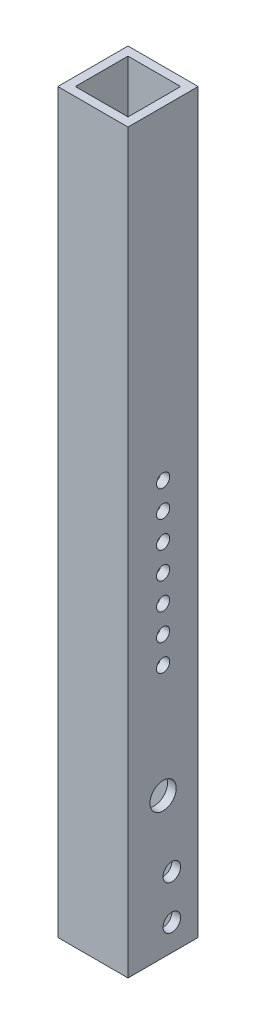
ISO-10303-21;
HEADER;
FILE_DESCRIPTION(('STEP AP214'),'2;1');
FILE_NAME('part.step','',(''),(''),'','','');
FILE_SCHEMA(('AUTOMOTIVE_DESIGN { 1 0 10303 214 1 1 1 1 }'));
ENDSEC;
DATA;
#1=APPLICATION_CONTEXT('core data for automotive mechanical design processes');
#2=APPLICATION_PROTOCOL_DEFINITION('international standard','automotive_design',2000,#1);
#3=PRODUCT_CONTEXT('',#1,'mechanical');
#4=PRODUCT('Part','Part','',(#3));
#5=PRODUCT_RELATED_PRODUCT_CATEGORY('part','',(#4));
#6=PRODUCT_DEFINITION_FORMATION('','',#4);
#7=PRODUCT_DEFINITION_CONTEXT('part definition',#1,'design');
#8=PRODUCT_DEFINITION('design','',#6,#7);
#9=PRODUCT_DEFINITION_SHAPE('','',#8);
#10=(LENGTH_UNIT() NAMED_UNIT(*) SI_UNIT(.MILLI.,.METRE.));
#11=(NAMED_UNIT(*) PLANE_ANGLE_UNIT() SI_UNIT($,.RADIAN.));
#12=(NAMED_UNIT(*) SI_UNIT($,.STERADIAN.) SOLID_ANGLE_UNIT());
#13=UNCERTAINTY_MEASURE_WITH_UNIT(LENGTH_MEASURE(1.E-05),#10,'distance_accuracy_value','');
#14=(GEOMETRIC_REPRESENTATION_CONTEXT(3) GLOBAL_UNCERTAINTY_ASSIGNED_CONTEXT((#13)) GLOBAL_UNIT_ASSIGNED_CONTEXT((#10,
#11,#12)) REPRESENTATION_CONTEXT('',''));
#15=CARTESIAN_POINT('',(0.,0.,0.));
#16=DIRECTION('',(0.,0.,1.));
#17=DIRECTION('',(1.,0.,0.));
#18=AXIS2_PLACEMENT_3D('',#15,#16,#17);
#19=CARTESIAN_POINT('',(12.7,-38.1,12.7));
#20=DIRECTION('',(1.,0.,0.));
#21=DIRECTION('',(0.,0.,-1.));
#22=AXIS2_PLACEMENT_3D('',#19,#20,#21);
#23=PLANE('',#22);
#24=CARTESIAN_POINT('',(12.7,-28.575,-3.175));
#25=DIRECTION('',(1.,0.,0.));
#26=DIRECTION('',(0.,0.,-1.));
#27=AXIS2_PLACEMENT_3D('',#24,#25,#26);
#28=CIRCLE('',#27,3.175);
#29=CARTESIAN_POINT('',(12.7,-28.575,-6.35));
#30=VERTEX_POINT('',#29);
#31=EDGE_CURVE('E354',#30,#30,#28,.T.);
#32=ORIENTED_EDGE('',*,*,#31,.F.);
#33=EDGE_LOOP('',(#32));
#34=FACE_BOUND('',#33,.T.);
#35=CARTESIAN_POINT('',(12.7,92.202,0.));
#36=DIRECTION('',(1.,0.,0.));
#37=DIRECTION('',(0.,0.,-1.));
#38=AXIS2_PLACEMENT_3D('',#35,#36,#37);
#39=CIRCLE('',#38,2.38125);
#40=CARTESIAN_POINT('',(12.7,92.202,-2.38124999999993));
#41=VERTEX_POINT('',#40);
#42=EDGE_CURVE('E358',#41,#41,#39,.T.);
#43=ORIENTED_EDGE('',*,*,#42,.F.);
#44=EDGE_LOOP('',(#43));
#45=FACE_BOUND('',#44,.T.);
#46=CARTESIAN_POINT('',(12.7,-12.7,-3.175));
#47=DIRECTION('',(1.,0.,0.));
#48=DIRECTION('',(0.,0.,-1.));
#49=AXIS2_PLACEMENT_3D('',#46,#47,#48);
#50=CIRCLE('',#49,3.175);
#51=CARTESIAN_POINT('',(12.7,-12.7,-6.35));
#52=VERTEX_POINT('',#51);
#53=EDGE_CURVE('E362',#52,#52,#50,.T.);
#54=ORIENTED_EDGE('',*,*,#53,.F.);
#55=EDGE_LOOP('',(#54));
#56=FACE_BOUND('',#55,.T.);
#57=CARTESIAN_POINT('',(12.7,63.246,0.));
#58=DIRECTION('',(1.,0.,0.));
#59=DIRECTION('',(0.,0.,-1.));
#60=AXIS2_PLACEMENT_3D('',#57,#58,#59);
#61=CIRCLE('',#60,2.38125);
#62=CARTESIAN_POINT('',(12.7,63.246,-2.38125));
#63=VERTEX_POINT('',#62);
#64=EDGE_CURVE('E366',#63,#63,#61,.T.);
#65=ORIENTED_EDGE('',*,*,#64,.F.);
#66=EDGE_LOOP('',(#65));
#67=FACE_BOUND('',#66,.T.);
#68=CARTESIAN_POINT('',(12.7,72.898,0.));
#69=DIRECTION('',(1.,0.,0.));
#70=DIRECTION('',(0.,0.,-1.));
#71=AXIS2_PLACEMENT_3D('',#68,#69,#70);
#72=CIRCLE('',#71,2.38125);
#73=CARTESIAN_POINT('',(12.7,72.898,-2.38125));
#74=VERTEX_POINT('',#73);
#75=EDGE_CURVE('E370',#74,#74,#72,.T.);
#76=ORIENTED_EDGE('',*,*,#75,.F.);
#77=EDGE_LOOP('',(#76));
#78=FACE_BOUND('',#77,.T.);
#79=CARTESIAN_POINT('',(12.7,82.55,0.));
#80=DIRECTION('',(1.,0.,0.));
#81=DIRECTION('',(0.,0.,-1.));
#82=AXIS2_PLACEMENT_3D('',#79,#80,#81);
#83=CIRCLE('',#82,2.38125);
#84=CARTESIAN_POINT('',(12.7,82.55,-2.38125));
#85=VERTEX_POINT('',#84);
#86=EDGE_CURVE('E374',#85,#85,#83,.T.);
#87=ORIENTED_EDGE('',*,*,#86,.F.);
#88=EDGE_LOOP('',(#87));
#89=FACE_BOUND('',#88,.T.);
#90=CARTESIAN_POINT('',(12.7,101.854,0.));
#91=DIRECTION('',(1.,0.,0.));
#92=DIRECTION('',(0.,0.,-1.));
#93=AXIS2_PLACEMENT_3D('',#90,#91,#92);
#94=CIRCLE('',#93,2.38125);
#95=CARTESIAN_POINT('',(12.7,101.854,-2.3812499999999));
#96=VERTEX_POINT('',#95);
#97=EDGE_CURVE('E378',#96,#96,#94,.T.);
#98=ORIENTED_EDGE('',*,*,#97,.F.);
#99=EDGE_LOOP('',(#98));
#100=FACE_BOUND('',#99,.T.);
#101=CARTESIAN_POINT('',(12.7,111.506,0.));
#102=DIRECTION('',(1.,0.,0.));
#103=DIRECTION('',(0.,0.,-1.));
#104=AXIS2_PLACEMENT_3D('',#101,#102,#103);
#105=CIRCLE('',#104,2.38125);
#106=CARTESIAN_POINT('',(12.7,111.506,-2.3812499999999));
#107=VERTEX_POINT('',#106);
#108=EDGE_CURVE('E382',#107,#107,#105,.T.);
#109=ORIENTED_EDGE('',*,*,#108,.F.);
#110=EDGE_LOOP('',(#109));
#111=FACE_BOUND('',#110,.T.);
#112=CARTESIAN_POINT('',(12.7,12.7,0.));
#113=DIRECTION('',(1.,0.,0.));
#114=DIRECTION('',(0.,0.,-1.));
#115=AXIS2_PLACEMENT_3D('',#112,#113,#114);
#116=CIRCLE('',#115,4.7625);
#117=CARTESIAN_POINT('',(12.7,12.7,-4.7625));
#118=VERTEX_POINT('',#117);
#119=EDGE_CURVE('E386',#118,#118,#116,.T.);
#120=ORIENTED_EDGE('',*,*,#119,.F.);
#121=EDGE_LOOP('',(#120));
#122=FACE_BOUND('',#121,.T.);
#123=CARTESIAN_POINT('',(12.7,53.594,0.));
#124=DIRECTION('',(1.,0.,0.));
#125=DIRECTION('',(0.,0.,-1.));
#126=AXIS2_PLACEMENT_3D('',#123,#124,#125);
#127=CIRCLE('',#126,2.38125);
#128=CARTESIAN_POINT('',(12.7,53.594,-2.38125));
#129=VERTEX_POINT('',#128);
#130=EDGE_CURVE('E390',#129,#129,#127,.T.);
#131=ORIENTED_EDGE('',*,*,#130,.F.);
#132=EDGE_LOOP('',(#131));
#133=FACE_BOUND('',#132,.T.);
#134=DIRECTION('',(0.,1.,0.));
#135=VECTOR('',#134,1.);
#136=CARTESIAN_POINT('',(12.7,-38.1,-12.7));
#137=LINE('',#136,#135);
#138=CARTESIAN_POINT('',(12.7,-38.1,-12.7));
#139=VERTEX_POINT('',#138);
#140=CARTESIAN_POINT('',(12.7,228.6,-12.7));
#141=VERTEX_POINT('',#140);
#142=EDGE_CURVE('E243',#139,#141,#137,.T.);
#143=ORIENTED_EDGE('',*,*,#142,.T.);
#144=DIRECTION('',(0.,0.,-1.));
#145=VECTOR('',#144,1.);
#146=CARTESIAN_POINT('',(12.7,228.6,12.7));
#147=LINE('',#146,#145);
#148=CARTESIAN_POINT('',(12.7,228.6,12.7));
#149=VERTEX_POINT('',#148);
#150=EDGE_CURVE('E184',#149,#141,#147,.T.);
#151=ORIENTED_EDGE('',*,*,#150,.F.);
#152=DIRECTION('',(0.,1.,0.));
#153=VECTOR('',#152,1.);
#154=CARTESIAN_POINT('',(12.7,-38.1,12.7));
#155=LINE('',#154,#153);
#156=CARTESIAN_POINT('',(12.7,-38.1,12.7));
#157=VERTEX_POINT('',#156);
#158=EDGE_CURVE('E11',#157,#149,#155,.T.);
#159=ORIENTED_EDGE('',*,*,#158,.F.);
#160=DIRECTION('',(0.,0.,-1.));
#161=VECTOR('',#160,1.);
#162=CARTESIAN_POINT('',(12.7,-38.1,12.7));
#163=LINE('',#162,#161);
#164=EDGE_CURVE('E220',#157,#139,#163,.T.);
#165=ORIENTED_EDGE('',*,*,#164,.T.);
#166=EDGE_LOOP('',(#143,#151,#159,#165));
#167=FACE_BOUND('',#166,.T.);
#168=ADVANCED_FACE('F43',(#34,#45,#56,#67,#78,#89,#100,#111,#122,#133,#167),#23,.T.);
#169=CARTESIAN_POINT('',(-12.7,-38.1,12.7));
#170=DIRECTION('',(0.,0.,1.));
#171=DIRECTION('',(1.,0.,0.));
#172=AXIS2_PLACEMENT_3D('',#169,#170,#171);
#173=PLANE('',#172);
#174=ORIENTED_EDGE('',*,*,#158,.T.);
#175=DIRECTION('',(1.,0.,0.));
#176=VECTOR('',#175,1.);
#177=CARTESIAN_POINT('',(-12.7,228.6,12.7));
#178=LINE('',#177,#176);
#179=CARTESIAN_POINT('',(-12.7,228.6,12.7));
#180=VERTEX_POINT('',#179);
#181=EDGE_CURVE('E196',#180,#149,#178,.T.);
#182=ORIENTED_EDGE('',*,*,#181,.F.);
#183=DIRECTION('',(0.,1.,0.));
#184=VECTOR('',#183,1.);
#185=CARTESIAN_POINT('',(-12.7,-38.1,12.7));
#186=LINE('',#185,#184);
#187=CARTESIAN_POINT('',(-12.7,-38.1,12.7));
#188=VERTEX_POINT('',#187);
#189=EDGE_CURVE('E52',#188,#180,#186,.T.);
#190=ORIENTED_EDGE('',*,*,#189,.F.);
#191=DIRECTION('',(1.,0.,0.));
#192=VECTOR('',#191,1.);
#193=CARTESIAN_POINT('',(-12.7,-38.1,12.7));
#194=LINE('',#193,#192);
#195=EDGE_CURVE('E240',#188,#157,#194,.T.);
#196=ORIENTED_EDGE('',*,*,#195,.T.);
#197=EDGE_LOOP('',(#174,#182,#190,#196));
#198=FACE_BOUND('',#197,.T.);
#199=ADVANCED_FACE('F343',(#198),#173,.T.);
#200=CARTESIAN_POINT('',(-12.7,-38.1,12.7));
#201=DIRECTION('',(-1.,0.,0.));
#202=DIRECTION('',(0.,0.,1.));
#203=AXIS2_PLACEMENT_3D('',#200,#201,#202);
#204=PLANE('',#203);
#205=CARTESIAN_POINT('',(-12.7,-28.575,-3.175));
#206=DIRECTION('',(1.,0.,0.));
#207=DIRECTION('',(0.,0.,-1.));
#208=AXIS2_PLACEMENT_3D('',#205,#206,#207);
#209=CIRCLE('',#208,3.175);
#210=CARTESIAN_POINT('',(-12.7,-28.575,-6.35));
#211=VERTEX_POINT('',#210);
#212=EDGE_CURVE('E257',#211,#211,#209,.T.);
#213=ORIENTED_EDGE('',*,*,#212,.T.);
#214=EDGE_LOOP('',(#213));
#215=FACE_BOUND('',#214,.T.);
#216=CARTESIAN_POINT('',(-12.7,92.202,0.));
#217=DIRECTION('',(1.,0.,0.));
#218=DIRECTION('',(0.,0.,-1.));
#219=AXIS2_PLACEMENT_3D('',#216,#217,#218);
#220=CIRCLE('',#219,2.38125);
#221=CARTESIAN_POINT('',(-12.7,92.202,-2.38124999999993));
#222=VERTEX_POINT('',#221);
#223=EDGE_CURVE('E908',#222,#222,#220,.T.);
#224=ORIENTED_EDGE('',*,*,#223,.T.);
#225=EDGE_LOOP('',(#224));
#226=FACE_BOUND('',#225,.T.);
#227=CARTESIAN_POINT('',(-12.7,-12.7,-3.175));
#228=DIRECTION('',(1.,0.,0.));
#229=DIRECTION('',(0.,0.,-1.));
#230=AXIS2_PLACEMENT_3D('',#227,#228,#229);
#231=CIRCLE('',#230,3.175);
#232=CARTESIAN_POINT('',(-12.7,-12.7,-6.35));
#233=VERTEX_POINT('',#232);
#234=EDGE_CURVE('E878',#233,#233,#231,.T.);
#235=ORIENTED_EDGE('',*,*,#234,.T.);
#236=EDGE_LOOP('',(#235));
#237=FACE_BOUND('',#236,.T.);
#238=CARTESIAN_POINT('',(-12.7,63.246,0.));
#239=DIRECTION('',(1.,0.,0.));
#240=DIRECTION('',(0.,0.,-1.));
#241=AXIS2_PLACEMENT_3D('',#238,#239,#240);
#242=CIRCLE('',#241,2.38125);
#243=CARTESIAN_POINT('',(-12.7,63.246,-2.38125));
#244=VERTEX_POINT('',#243);
#245=EDGE_CURVE('E872',#244,#244,#242,.T.);
#246=ORIENTED_EDGE('',*,*,#245,.T.);
#247=EDGE_LOOP('',(#246));
#248=FACE_BOUND('',#247,.T.);
#249=CARTESIAN_POINT('',(-12.7,72.898,0.));
#250=DIRECTION('',(1.,0.,0.));
#251=DIRECTION('',(0.,0.,-1.));
#252=AXIS2_PLACEMENT_3D('',#249,#250,#251);
#253=CIRCLE('',#252,2.38125);
#254=CARTESIAN_POINT('',(-12.7,72.898,-2.38125));
#255=VERTEX_POINT('',#254);
#256=EDGE_CURVE('E866',#255,#255,#253,.T.);
#257=ORIENTED_EDGE('',*,*,#256,.T.);
#258=EDGE_LOOP('',(#257));
#259=FACE_BOUND('',#258,.T.);
#260=CARTESIAN_POINT('',(-12.7,82.55,0.));
#261=DIRECTION('',(1.,0.,0.));
#262=DIRECTION('',(0.,0.,-1.));
#263=AXIS2_PLACEMENT_3D('',#260,#261,#262);
#264=CIRCLE('',#263,2.38125);
#265=CARTESIAN_POINT('',(-12.7,82.55,-2.38125));
#266=VERTEX_POINT('',#265);
#267=EDGE_CURVE('E851',#266,#266,#264,.T.);
#268=ORIENTED_EDGE('',*,*,#267,.T.);
#269=EDGE_LOOP('',(#268));
#270=FACE_BOUND('',#269,.T.);
#271=CARTESIAN_POINT('',(-12.7,101.854,0.));
#272=DIRECTION('',(1.,0.,0.));
#273=DIRECTION('',(0.,0.,-1.));
#274=AXIS2_PLACEMENT_3D('',#271,#272,#273);
#275=CIRCLE('',#274,2.38125);
#276=CARTESIAN_POINT('',(-12.7,101.854,-2.3812499999999));
#277=VERTEX_POINT('',#276);
#278=EDGE_CURVE('E902',#277,#277,#275,.T.);
#279=ORIENTED_EDGE('',*,*,#278,.T.);
#280=EDGE_LOOP('',(#279));
#281=FACE_BOUND('',#280,.T.);
#282=CARTESIAN_POINT('',(-12.7,111.506,0.));
#283=DIRECTION('',(1.,0.,0.));
#284=DIRECTION('',(0.,0.,-1.));
#285=AXIS2_PLACEMENT_3D('',#282,#283,#284);
#286=CIRCLE('',#285,2.38125);
#287=CARTESIAN_POINT('',(-12.7,111.506,-2.3812499999999));
#288=VERTEX_POINT('',#287);
#289=EDGE_CURVE('E896',#288,#288,#286,.T.);
#290=ORIENTED_EDGE('',*,*,#289,.T.);
#291=EDGE_LOOP('',(#290));
#292=FACE_BOUND('',#291,.T.);
#293=CARTESIAN_POINT('',(-12.7,12.7,0.));
#294=DIRECTION('',(1.,0.,0.));
#295=DIRECTION('',(0.,0.,-1.));
#296=AXIS2_PLACEMENT_3D('',#293,#294,#295);
#297=CIRCLE('',#296,4.7625);
#298=CARTESIAN_POINT('',(-12.7,12.7,-4.7625));
#299=VERTEX_POINT('',#298);
#300=EDGE_CURVE('E890',#299,#299,#297,.T.);
#301=ORIENTED_EDGE('',*,*,#300,.T.);
#302=EDGE_LOOP('',(#301));
#303=FACE_BOUND('',#302,.T.);
#304=CARTESIAN_POINT('',(-12.7,53.594,0.));
#305=DIRECTION('',(1.,0.,0.));
#306=DIRECTION('',(0.,0.,-1.));
#307=AXIS2_PLACEMENT_3D('',#304,#305,#306);
#308=CIRCLE('',#307,2.38125);
#309=CARTESIAN_POINT('',(-12.7,53.594,-2.38125));
#310=VERTEX_POINT('',#309);
#311=EDGE_CURVE('E884',#310,#310,#308,.T.);
#312=ORIENTED_EDGE('',*,*,#311,.T.);
#313=EDGE_LOOP('',(#312));
#314=FACE_BOUND('',#313,.T.);
#315=ORIENTED_EDGE('',*,*,#189,.T.);
#316=DIRECTION('',(0.,0.,1.));
#317=VECTOR('',#316,1.);
#318=CARTESIAN_POINT('',(-12.7,228.6,12.7));
#319=LINE('',#318,#317);
#320=CARTESIAN_POINT('',(-12.7,228.6,-12.7));
#321=VERTEX_POINT('',#320);
#322=EDGE_CURVE('E192',#321,#180,#319,.T.);
#323=ORIENTED_EDGE('',*,*,#322,.F.);
#324=DIRECTION('',(0.,1.,0.));
#325=VECTOR('',#324,1.);
#326=CARTESIAN_POINT('',(-12.7,-38.1,-12.7));
#327=LINE('',#326,#325);
#328=CARTESIAN_POINT('',(-12.7,-38.1,-12.7));
#329=VERTEX_POINT('',#328);
#330=EDGE_CURVE('E247',#329,#321,#327,.T.);
#331=ORIENTED_EDGE('',*,*,#330,.F.);
#332=DIRECTION('',(0.,0.,1.));
#333=VECTOR('',#332,1.);
#334=CARTESIAN_POINT('',(-12.7,-38.1,12.7));
#335=LINE('',#334,#333);
#336=EDGE_CURVE('E236',#329,#188,#335,.T.);
#337=ORIENTED_EDGE('',*,*,#336,.T.);
#338=EDGE_LOOP('',(#315,#323,#331,#337));
#339=FACE_BOUND('',#338,.T.);
#340=ADVANCED_FACE('F348',(#215,#226,#237,#248,#259,#270,#281,#292,#303,#314,#339),#204,.T.);
#341=CARTESIAN_POINT('',(-12.7,-38.1,-12.7));
#342=DIRECTION('',(0.,0.,-1.));
#343=DIRECTION('',(-1.,0.,0.));
#344=AXIS2_PLACEMENT_3D('',#341,#342,#343);
#345=PLANE('',#344);
#346=DIRECTION('',(1.,0.,0.));
#347=VECTOR('',#346,1.);
#348=CARTESIAN_POINT('',(5.07999999999999,120.65,-12.7));
#349=LINE('',#348,#347);
#350=CARTESIAN_POINT('',(-5.08000000000001,120.65,-12.7));
#351=VERTEX_POINT('',#350);
#352=CARTESIAN_POINT('',(5.07999999999999,120.65,-12.7));
#353=VERTEX_POINT('',#352);
#354=EDGE_CURVE('E321',#351,#353,#349,.T.);
#355=ORIENTED_EDGE('',*,*,#354,.F.);
#356=DIRECTION('',(0.,1.,0.));
#357=VECTOR('',#356,1.);
#358=CARTESIAN_POINT('',(-5.08,44.45,-12.7));
#359=LINE('',#358,#357);
#360=CARTESIAN_POINT('',(-5.08,44.45,-12.7));
#361=VERTEX_POINT('',#360);
#362=EDGE_CURVE('E157',#361,#351,#359,.T.);
#363=ORIENTED_EDGE('',*,*,#362,.F.);
#364=DIRECTION('',(-1.,0.,0.));
#365=VECTOR('',#364,1.);
#366=CARTESIAN_POINT('',(5.08,44.45,-12.7));
#367=LINE('',#366,#365);
#368=CARTESIAN_POINT('',(5.08,44.45,-12.7));
#369=VERTEX_POINT('',#368);
#370=EDGE_CURVE('E60',#369,#361,#367,.T.);
#371=ORIENTED_EDGE('',*,*,#370,.F.);
#372=DIRECTION('',(0.,-1.,0.));
#373=VECTOR('',#372,1.);
#374=CARTESIAN_POINT('',(5.08,44.45,-12.7));
#375=LINE('',#374,#373);
#376=EDGE_CURVE('E317',#353,#369,#375,.T.);
#377=ORIENTED_EDGE('',*,*,#376,.F.);
#378=EDGE_LOOP('',(#355,#363,#371,#377));
#379=FACE_BOUND('',#378,.T.);
#380=ORIENTED_EDGE('',*,*,#330,.T.);
#381=DIRECTION('',(-1.,0.,0.));
#382=VECTOR('',#381,1.);
#383=CARTESIAN_POINT('',(-12.7,228.6,-12.7));
#384=LINE('',#383,#382);
#385=EDGE_CURVE('E188',#141,#321,#384,.T.);
#386=ORIENTED_EDGE('',*,*,#385,.F.);
#387=ORIENTED_EDGE('',*,*,#142,.F.);
#388=DIRECTION('',(-1.,0.,0.));
#389=VECTOR('',#388,1.);
#390=CARTESIAN_POINT('',(-12.7,-38.1,-12.7));
#391=LINE('',#390,#389);
#392=EDGE_CURVE('E232',#139,#329,#391,.T.);
#393=ORIENTED_EDGE('',*,*,#392,.T.);
#394=EDGE_LOOP('',(#380,#386,#387,#393));
#395=FACE_BOUND('',#394,.T.);
#396=ADVANCED_FACE('F328',(#379,#395),#345,.T.);
#397=CARTESIAN_POINT('',(0.,-38.1,0.));
#398=DIRECTION('',(0.,-1.,0.));
#399=DIRECTION('',(0.,0.,-1.));
#400=AXIS2_PLACEMENT_3D('',#397,#398,#399);
#401=PLANE('',#400);
#402=DIRECTION('',(0.,0.,-1.));
#403=VECTOR('',#402,1.);
#404=CARTESIAN_POINT('',(9.525,-38.1,9.525));
#405=LINE('',#404,#403);
#406=CARTESIAN_POINT('',(9.525,-38.1,9.525));
#407=VERTEX_POINT('',#406);
#408=CARTESIAN_POINT('',(9.525,-38.1,-9.525));
#409=VERTEX_POINT('',#408);
#410=EDGE_CURVE('E200',#407,#409,#405,.T.);
#411=ORIENTED_EDGE('',*,*,#410,.T.);
#412=DIRECTION('',(-1.,0.,0.));
#413=VECTOR('',#412,1.);
#414=CARTESIAN_POINT('',(-9.525,-38.1,-9.525));
#415=LINE('',#414,#413);
#416=CARTESIAN_POINT('',(-9.525,-38.1,-9.525));
#417=VERTEX_POINT('',#416);
#418=EDGE_CURVE('E204',#409,#417,#415,.T.);
#419=ORIENTED_EDGE('',*,*,#418,.T.);
#420=DIRECTION('',(0.,0.,1.));
#421=VECTOR('',#420,1.);
#422=CARTESIAN_POINT('',(-9.525,-38.1,9.525));
#423=LINE('',#422,#421);
#424=CARTESIAN_POINT('',(-9.525,-38.1,9.525));
#425=VERTEX_POINT('',#424);
#426=EDGE_CURVE('E208',#417,#425,#423,.T.);
#427=ORIENTED_EDGE('',*,*,#426,.T.);
#428=DIRECTION('',(1.,0.,0.));
#429=VECTOR('',#428,1.);
#430=CARTESIAN_POINT('',(-9.525,-38.1,9.525));
#431=LINE('',#430,#429);
#432=EDGE_CURVE('E212',#425,#407,#431,.T.);
#433=ORIENTED_EDGE('',*,*,#432,.T.);
#434=EDGE_LOOP('',(#411,#419,#427,#433));
#435=FACE_BOUND('',#434,.T.);
#436=ORIENTED_EDGE('',*,*,#164,.F.);
#437=ORIENTED_EDGE('',*,*,#195,.F.);
#438=ORIENTED_EDGE('',*,*,#336,.F.);
#439=ORIENTED_EDGE('',*,*,#392,.F.);
#440=EDGE_LOOP('',(#436,#437,#438,#439));
#441=FACE_BOUND('',#440,.T.);
#442=ADVANCED_FACE('F401',(#435,#441),#401,.T.);
#443=CARTESIAN_POINT('',(9.525,-38.1,9.525));
#444=DIRECTION('',(1.,0.,0.));
#445=DIRECTION('',(0.,0.,-1.));
#446=AXIS2_PLACEMENT_3D('',#443,#444,#445);
#447=PLANE('',#446);
#448=CARTESIAN_POINT('',(9.525,-28.575,-3.175));
#449=DIRECTION('',(1.,0.,0.));
#450=DIRECTION('',(0.,0.,-1.));
#451=AXIS2_PLACEMENT_3D('',#448,#449,#450);
#452=CIRCLE('',#451,3.175);
#453=CARTESIAN_POINT('',(9.525,-28.575,-6.35));
#454=VERTEX_POINT('',#453);
#455=EDGE_CURVE('E309',#454,#454,#452,.T.);
#456=ORIENTED_EDGE('',*,*,#455,.T.);
#457=EDGE_LOOP('',(#456));
#458=FACE_BOUND('',#457,.T.);
#459=CARTESIAN_POINT('',(9.525,92.202,0.));
#460=DIRECTION('',(1.,0.,0.));
#461=DIRECTION('',(0.,0.,-1.));
#462=AXIS2_PLACEMENT_3D('',#459,#460,#461);
#463=CIRCLE('',#462,2.38125);
#464=CARTESIAN_POINT('',(9.525,92.202,-2.38124999999993));
#465=VERTEX_POINT('',#464);
#466=EDGE_CURVE('E295',#465,#465,#463,.T.);
#467=ORIENTED_EDGE('',*,*,#466,.T.);
#468=EDGE_LOOP('',(#467));
#469=FACE_BOUND('',#468,.T.);
#470=CARTESIAN_POINT('',(9.525,-12.7,-3.175));
#471=DIRECTION('',(1.,0.,0.));
#472=DIRECTION('',(0.,0.,-1.));
#473=AXIS2_PLACEMENT_3D('',#470,#471,#472);
#474=CIRCLE('',#473,3.175);
#475=CARTESIAN_POINT('',(9.525,-12.7,-6.35));
#476=VERTEX_POINT('',#475);
#477=EDGE_CURVE('E291',#476,#476,#474,.T.);
#478=ORIENTED_EDGE('',*,*,#477,.T.);
#479=EDGE_LOOP('',(#478));
#480=FACE_BOUND('',#479,.T.);
#481=CARTESIAN_POINT('',(9.525,63.246,0.));
#482=DIRECTION('',(1.,0.,0.));
#483=DIRECTION('',(0.,0.,-1.));
#484=AXIS2_PLACEMENT_3D('',#481,#482,#483);
#485=CIRCLE('',#484,2.38125);
#486=CARTESIAN_POINT('',(9.525,63.246,-2.38125));
#487=VERTEX_POINT('',#486);
#488=EDGE_CURVE('E287',#487,#487,#485,.T.);
#489=ORIENTED_EDGE('',*,*,#488,.T.);
#490=EDGE_LOOP('',(#489));
#491=FACE_BOUND('',#490,.T.);
#492=CARTESIAN_POINT('',(9.525,72.898,0.));
#493=DIRECTION('',(1.,0.,0.));
#494=DIRECTION('',(0.,0.,-1.));
#495=AXIS2_PLACEMENT_3D('',#492,#493,#494);
#496=CIRCLE('',#495,2.38125);
#497=CARTESIAN_POINT('',(9.525,72.898,-2.38125));
#498=VERTEX_POINT('',#497);
#499=EDGE_CURVE('E282',#498,#498,#496,.T.);
#500=ORIENTED_EDGE('',*,*,#499,.T.);
#501=EDGE_LOOP('',(#500));
#502=FACE_BOUND('',#501,.T.);
#503=CARTESIAN_POINT('',(9.525,82.55,0.));
#504=DIRECTION('',(1.,0.,0.));
#505=DIRECTION('',(0.,0.,-1.));
#506=AXIS2_PLACEMENT_3D('',#503,#504,#505);
#507=CIRCLE('',#506,2.38125);
#508=CARTESIAN_POINT('',(9.525,82.55,-2.38125));
#509=VERTEX_POINT('',#508);
#510=EDGE_CURVE('E277',#509,#509,#507,.T.);
#511=ORIENTED_EDGE('',*,*,#510,.T.);
#512=EDGE_LOOP('',(#511));
#513=FACE_BOUND('',#512,.T.);
#514=CARTESIAN_POINT('',(9.525,101.854,0.));
#515=DIRECTION('',(1.,0.,0.));
#516=DIRECTION('',(0.,0.,-1.));
#517=AXIS2_PLACEMENT_3D('',#514,#515,#516);
#518=CIRCLE('',#517,2.38125);
#519=CARTESIAN_POINT('',(9.525,101.854,-2.3812499999999));
#520=VERTEX_POINT('',#519);
#521=EDGE_CURVE('E272',#520,#520,#518,.T.);
#522=ORIENTED_EDGE('',*,*,#521,.T.);
#523=EDGE_LOOP('',(#522));
#524=FACE_BOUND('',#523,.T.);
#525=CARTESIAN_POINT('',(9.525,111.506,0.));
#526=DIRECTION('',(1.,0.,0.));
#527=DIRECTION('',(0.,0.,-1.));
#528=AXIS2_PLACEMENT_3D('',#525,#526,#527);
#529=CIRCLE('',#528,2.38125);
#530=CARTESIAN_POINT('',(9.525,111.506,-2.3812499999999));
#531=VERTEX_POINT('',#530);
#532=EDGE_CURVE('E267',#531,#531,#529,.T.);
#533=ORIENTED_EDGE('',*,*,#532,.T.);
#534=EDGE_LOOP('',(#533));
#535=FACE_BOUND('',#534,.T.);
#536=CARTESIAN_POINT('',(9.525,12.7,0.));
#537=DIRECTION('',(1.,0.,0.));
#538=DIRECTION('',(0.,0.,-1.));
#539=AXIS2_PLACEMENT_3D('',#536,#537,#538);
#540=CIRCLE('',#539,4.7625);
#541=CARTESIAN_POINT('',(9.525,12.7,-4.7625));
#542=VERTEX_POINT('',#541);
#543=EDGE_CURVE('E262',#542,#542,#540,.T.);
#544=ORIENTED_EDGE('',*,*,#543,.T.);
#545=EDGE_LOOP('',(#544));
#546=FACE_BOUND('',#545,.T.);
#547=CARTESIAN_POINT('',(9.525,53.594,0.));
#548=DIRECTION('',(1.,0.,0.));
#549=DIRECTION('',(0.,0.,-1.));
#550=AXIS2_PLACEMENT_3D('',#547,#548,#549);
#551=CIRCLE('',#550,2.38125);
#552=CARTESIAN_POINT('',(9.525,53.594,-2.38125));
#553=VERTEX_POINT('',#552);
#554=EDGE_CURVE('E256',#553,#553,#551,.T.);
#555=ORIENTED_EDGE('',*,*,#554,.T.);
#556=EDGE_LOOP('',(#555));
#557=FACE_BOUND('',#556,.T.);
#558=DIRECTION('',(0.,1.,0.));
#559=VECTOR('',#558,1.);
#560=CARTESIAN_POINT('',(9.525,-38.1,9.525));
#561=LINE('',#560,#559);
#562=CARTESIAN_POINT('',(9.525,228.6,9.525));
#563=VERTEX_POINT('',#562);
#564=EDGE_CURVE('E217',#407,#563,#561,.T.);
#565=ORIENTED_EDGE('',*,*,#564,.T.);
#566=DIRECTION('',(0.,0.,-1.));
#567=VECTOR('',#566,1.);
#568=CARTESIAN_POINT('',(9.525,228.6,9.525));
#569=LINE('',#568,#567);
#570=CARTESIAN_POINT('',(9.525,228.6,-9.525));
#571=VERTEX_POINT('',#570);
#572=EDGE_CURVE('E168',#563,#571,#569,.T.);
#573=ORIENTED_EDGE('',*,*,#572,.T.);
#574=DIRECTION('',(0.,1.,0.));
#575=VECTOR('',#574,1.);
#576=CARTESIAN_POINT('',(9.525,-38.1,-9.525));
#577=LINE('',#576,#575);
#578=EDGE_CURVE('E216',#409,#571,#577,.T.);
#579=ORIENTED_EDGE('',*,*,#578,.F.);
#580=ORIENTED_EDGE('',*,*,#410,.F.);
#581=EDGE_LOOP('',(#565,#573,#579,#580));
#582=FACE_BOUND('',#581,.T.);
#583=ADVANCED_FACE('F415',(#458,#469,#480,#491,#502,#513,#524,#535,#546,#557,#582),#447,.F.);
#584=CARTESIAN_POINT('',(-9.525,-38.1,9.525));
#585=DIRECTION('',(0.,0.,1.));
#586=DIRECTION('',(1.,0.,0.));
#587=AXIS2_PLACEMENT_3D('',#584,#585,#586);
#588=PLANE('',#587);
#589=DIRECTION('',(0.,1.,0.));
#590=VECTOR('',#589,1.);
#591=CARTESIAN_POINT('',(-9.525,-38.1,9.525));
#592=LINE('',#591,#590);
#593=CARTESIAN_POINT('',(-9.525,228.6,9.525));
#594=VERTEX_POINT('',#593);
#595=EDGE_CURVE('E221',#425,#594,#592,.T.);
#596=ORIENTED_EDGE('',*,*,#595,.T.);
#597=DIRECTION('',(1.,0.,0.));
#598=VECTOR('',#597,1.);
#599=CARTESIAN_POINT('',(-9.525,228.6,9.525));
#600=LINE('',#599,#598);
#601=EDGE_CURVE('E180',#594,#563,#600,.T.);
#602=ORIENTED_EDGE('',*,*,#601,.T.);
#603=ORIENTED_EDGE('',*,*,#564,.F.);
#604=ORIENTED_EDGE('',*,*,#432,.F.);
#605=EDGE_LOOP('',(#596,#602,#603,#604));
#606=FACE_BOUND('',#605,.T.);
#607=ADVANCED_FACE('F419',(#606),#588,.F.);
#608=CARTESIAN_POINT('',(-9.525,-38.1,9.525));
#609=DIRECTION('',(-1.,0.,0.));
#610=DIRECTION('',(0.,0.,1.));
#611=AXIS2_PLACEMENT_3D('',#608,#609,#610);
#612=PLANE('',#611);
#613=CARTESIAN_POINT('',(-9.525,-28.575,-3.175));
#614=DIRECTION('',(-1.,0.,0.));
#615=DIRECTION('',(0.,0.,1.));
#616=AXIS2_PLACEMENT_3D('',#613,#614,#615);
#617=CIRCLE('',#616,3.175);
#618=CARTESIAN_POINT('',(-9.525,-28.575,0.));
#619=VERTEX_POINT('',#618);
#620=EDGE_CURVE('E46',#619,#619,#617,.T.);
#621=ORIENTED_EDGE('',*,*,#620,.T.);
#622=EDGE_LOOP('',(#621));
#623=FACE_BOUND('',#622,.T.);
#624=CARTESIAN_POINT('',(-9.525,92.202,0.));
#625=DIRECTION('',(-1.,0.,0.));
#626=DIRECTION('',(0.,0.,1.));
#627=AXIS2_PLACEMENT_3D('',#624,#625,#626);
#628=CIRCLE('',#627,2.38125);
#629=CARTESIAN_POINT('',(-9.525,92.202,2.38125000000007));
#630=VERTEX_POINT('',#629);
#631=EDGE_CURVE('E292',#630,#630,#628,.T.);
#632=ORIENTED_EDGE('',*,*,#631,.T.);
#633=EDGE_LOOP('',(#632));
#634=FACE_BOUND('',#633,.T.);
#635=CARTESIAN_POINT('',(-9.525,-12.7,-3.175));
#636=DIRECTION('',(-1.,0.,0.));
#637=DIRECTION('',(0.,0.,1.));
#638=AXIS2_PLACEMENT_3D('',#635,#636,#637);
#639=CIRCLE('',#638,3.175);
#640=CARTESIAN_POINT('',(-9.525,-12.7,0.));
#641=VERTEX_POINT('',#640);
#642=EDGE_CURVE('E288',#641,#641,#639,.T.);
#643=ORIENTED_EDGE('',*,*,#642,.T.);
#644=EDGE_LOOP('',(#643));
#645=FACE_BOUND('',#644,.T.);
#646=CARTESIAN_POINT('',(-9.525,63.246,0.));
#647=DIRECTION('',(-1.,0.,0.));
#648=DIRECTION('',(0.,0.,1.));
#649=AXIS2_PLACEMENT_3D('',#646,#647,#648);
#650=CIRCLE('',#649,2.38125);
#651=CARTESIAN_POINT('',(-9.525,63.246,2.38125));
#652=VERTEX_POINT('',#651);
#653=EDGE_CURVE('E283',#652,#652,#650,.T.);
#654=ORIENTED_EDGE('',*,*,#653,.T.);
#655=EDGE_LOOP('',(#654));
#656=FACE_BOUND('',#655,.T.);
#657=CARTESIAN_POINT('',(-9.525,72.898,0.));
#658=DIRECTION('',(-1.,0.,0.));
#659=DIRECTION('',(0.,0.,1.));
#660=AXIS2_PLACEMENT_3D('',#657,#658,#659);
#661=CIRCLE('',#660,2.38125);
#662=CARTESIAN_POINT('',(-9.525,72.898,2.38125));
#663=VERTEX_POINT('',#662);
#664=EDGE_CURVE('E278',#663,#663,#661,.T.);
#665=ORIENTED_EDGE('',*,*,#664,.T.);
#666=EDGE_LOOP('',(#665));
#667=FACE_BOUND('',#666,.T.);
#668=CARTESIAN_POINT('',(-9.525,82.55,0.));
#669=DIRECTION('',(-1.,0.,0.));
#670=DIRECTION('',(0.,0.,1.));
#671=AXIS2_PLACEMENT_3D('',#668,#669,#670);
#672=CIRCLE('',#671,2.38125);
#673=CARTESIAN_POINT('',(-9.525,82.55,2.38125));
#674=VERTEX_POINT('',#673);
#675=EDGE_CURVE('E273',#674,#674,#672,.T.);
#676=ORIENTED_EDGE('',*,*,#675,.T.);
#677=EDGE_LOOP('',(#676));
#678=FACE_BOUND('',#677,.T.);
#679=CARTESIAN_POINT('',(-9.525,101.854,0.));
#680=DIRECTION('',(-1.,0.,0.));
#681=DIRECTION('',(0.,0.,1.));
#682=AXIS2_PLACEMENT_3D('',#679,#680,#681);
#683=CIRCLE('',#682,2.38125);
#684=CARTESIAN_POINT('',(-9.525,101.854,2.3812500000001));
#685=VERTEX_POINT('',#684);
#686=EDGE_CURVE('E268',#685,#685,#683,.T.);
#687=ORIENTED_EDGE('',*,*,#686,.T.);
#688=EDGE_LOOP('',(#687));
#689=FACE_BOUND('',#688,.T.);
#690=CARTESIAN_POINT('',(-9.525,111.506,0.));
#691=DIRECTION('',(-1.,0.,0.));
#692=DIRECTION('',(0.,0.,1.));
#693=AXIS2_PLACEMENT_3D('',#690,#691,#692);
#694=CIRCLE('',#693,2.38125);
#695=CARTESIAN_POINT('',(-9.525,111.506,2.3812500000001));
#696=VERTEX_POINT('',#695);
#697=EDGE_CURVE('E263',#696,#696,#694,.T.);
#698=ORIENTED_EDGE('',*,*,#697,.T.);
#699=EDGE_LOOP('',(#698));
#700=FACE_BOUND('',#699,.T.);
#701=CARTESIAN_POINT('',(-9.525,12.7,0.));
#702=DIRECTION('',(-1.,0.,0.));
#703=DIRECTION('',(0.,0.,1.));
#704=AXIS2_PLACEMENT_3D('',#701,#702,#703);
#705=CIRCLE('',#704,4.7625);
#706=CARTESIAN_POINT('',(-9.525,12.7,4.7625));
#707=VERTEX_POINT('',#706);
#708=EDGE_CURVE('E258',#707,#707,#705,.T.);
#709=ORIENTED_EDGE('',*,*,#708,.T.);
#710=EDGE_LOOP('',(#709));
#711=FACE_BOUND('',#710,.T.);
#712=CARTESIAN_POINT('',(-9.525,53.594,0.));
#713=DIRECTION('',(-1.,0.,0.));
#714=DIRECTION('',(0.,0.,1.));
#715=AXIS2_PLACEMENT_3D('',#712,#713,#714);
#716=CIRCLE('',#715,2.38125);
#717=CARTESIAN_POINT('',(-9.525,53.594,2.38125));
#718=VERTEX_POINT('',#717);
#719=EDGE_CURVE('E252',#718,#718,#716,.T.);
#720=ORIENTED_EDGE('',*,*,#719,.T.);
#721=EDGE_LOOP('',(#720));
#722=FACE_BOUND('',#721,.T.);
#723=DIRECTION('',(0.,1.,0.));
#724=VECTOR('',#723,1.);
#725=CARTESIAN_POINT('',(-9.525,-38.1,-9.525));
#726=LINE('',#725,#724);
#727=CARTESIAN_POINT('',(-9.525,228.6,-9.525));
#728=VERTEX_POINT('',#727);
#729=EDGE_CURVE('E224',#417,#728,#726,.T.);
#730=ORIENTED_EDGE('',*,*,#729,.T.);
#731=DIRECTION('',(0.,0.,1.));
#732=VECTOR('',#731,1.);
#733=CARTESIAN_POINT('',(-9.525,228.6,9.525));
#734=LINE('',#733,#732);
#735=EDGE_CURVE('E176',#728,#594,#734,.T.);
#736=ORIENTED_EDGE('',*,*,#735,.T.);
#737=ORIENTED_EDGE('',*,*,#595,.F.);
#738=ORIENTED_EDGE('',*,*,#426,.F.);
#739=EDGE_LOOP('',(#730,#736,#737,#738));
#740=FACE_BOUND('',#739,.T.);
#741=ADVANCED_FACE('F423',(#623,#634,#645,#656,#667,#678,#689,#700,#711,#722,#740),#612,.F.);
#742=CARTESIAN_POINT('',(-9.525,-38.1,-9.525));
#743=DIRECTION('',(0.,0.,-1.));
#744=DIRECTION('',(-1.,0.,0.));
#745=AXIS2_PLACEMENT_3D('',#742,#743,#744);
#746=PLANE('',#745);
#747=DIRECTION('',(0.,-1.,0.));
#748=VECTOR('',#747,1.);
#749=CARTESIAN_POINT('',(-5.08,44.45,-9.525));
#750=LINE('',#749,#748);
#751=CARTESIAN_POINT('',(-5.08000000000001,120.65,-9.525));
#752=VERTEX_POINT('',#751);
#753=CARTESIAN_POINT('',(-5.08,44.45,-9.52499999999999));
#754=VERTEX_POINT('',#753);
#755=EDGE_CURVE('E145',#752,#754,#750,.T.);
#756=ORIENTED_EDGE('',*,*,#755,.F.);
#757=DIRECTION('',(-1.,0.,0.));
#758=VECTOR('',#757,1.);
#759=CARTESIAN_POINT('',(5.07999999999999,120.65,-9.525));
#760=LINE('',#759,#758);
#761=CARTESIAN_POINT('',(5.07999999999999,120.65,-9.52499999999999));
#762=VERTEX_POINT('',#761);
#763=EDGE_CURVE('E68',#762,#752,#760,.T.);
#764=ORIENTED_EDGE('',*,*,#763,.F.);
#765=DIRECTION('',(0.,1.,0.));
#766=VECTOR('',#765,1.);
#767=CARTESIAN_POINT('',(5.08,44.45,-9.525));
#768=LINE('',#767,#766);
#769=CARTESIAN_POINT('',(5.08,44.45,-9.52499999999999));
#770=VERTEX_POINT('',#769);
#771=EDGE_CURVE('E153',#770,#762,#768,.T.);
#772=ORIENTED_EDGE('',*,*,#771,.F.);
#773=DIRECTION('',(1.,0.,0.));
#774=VECTOR('',#773,1.);
#775=CARTESIAN_POINT('',(5.08,44.45,-9.525));
#776=LINE('',#775,#774);
#777=EDGE_CURVE('E135',#754,#770,#776,.T.);
#778=ORIENTED_EDGE('',*,*,#777,.F.);
#779=EDGE_LOOP('',(#756,#764,#772,#778));
#780=FACE_BOUND('',#779,.T.);
#781=ORIENTED_EDGE('',*,*,#578,.T.);
#782=DIRECTION('',(-1.,0.,0.));
#783=VECTOR('',#782,1.);
#784=CARTESIAN_POINT('',(-9.525,228.6,-9.525));
#785=LINE('',#784,#783);
#786=EDGE_CURVE('E172',#571,#728,#785,.T.);
#787=ORIENTED_EDGE('',*,*,#786,.T.);
#788=ORIENTED_EDGE('',*,*,#729,.F.);
#789=ORIENTED_EDGE('',*,*,#418,.F.);
#790=EDGE_LOOP('',(#781,#787,#788,#789));
#791=FACE_BOUND('',#790,.T.);
#792=ADVANCED_FACE('F150',(#780,#791),#746,.F.);
#793=CARTESIAN_POINT('',(0.,228.6,0.));
#794=DIRECTION('',(0.,-1.,0.));
#795=DIRECTION('',(0.,0.,-1.));
#796=AXIS2_PLACEMENT_3D('',#793,#794,#795);
#797=PLANE('',#796);
#798=ORIENTED_EDGE('',*,*,#150,.T.);
#799=ORIENTED_EDGE('',*,*,#385,.T.);
#800=ORIENTED_EDGE('',*,*,#322,.T.);
#801=ORIENTED_EDGE('',*,*,#181,.T.);
#802=EDGE_LOOP('',(#798,#799,#800,#801));
#803=FACE_BOUND('',#802,.T.);
#804=ORIENTED_EDGE('',*,*,#572,.F.);
#805=ORIENTED_EDGE('',*,*,#601,.F.);
#806=ORIENTED_EDGE('',*,*,#735,.F.);
#807=ORIENTED_EDGE('',*,*,#786,.F.);
#808=EDGE_LOOP('',(#804,#805,#806,#807));
#809=FACE_BOUND('',#808,.T.);
#810=ADVANCED_FACE('F340',(#803,#809),#797,.F.);
#811=CARTESIAN_POINT('',(5.07999999999999,120.65,12.701));
#812=DIRECTION('',(0.,1.,0.));
#813=DIRECTION('',(0.,0.,1.));
#814=AXIS2_PLACEMENT_3D('',#811,#812,#813);
#815=PLANE('',#814);
#816=ORIENTED_EDGE('',*,*,#763,.T.);
#817=DIRECTION('',(0.,0.,-1.));
#818=VECTOR('',#817,1.);
#819=CARTESIAN_POINT('',(-5.08000000000001,120.65,12.701));
#820=LINE('',#819,#818);
#821=EDGE_CURVE('E141',#752,#351,#820,.T.);
#822=ORIENTED_EDGE('',*,*,#821,.T.);
#823=ORIENTED_EDGE('',*,*,#354,.T.);
#824=DIRECTION('',(0.,0.,-1.));
#825=VECTOR('',#824,1.);
#826=CARTESIAN_POINT('',(5.07999999999999,120.65,12.701));
#827=LINE('',#826,#825);
#828=EDGE_CURVE('E163',#762,#353,#827,.T.);
#829=ORIENTED_EDGE('',*,*,#828,.F.);
#830=EDGE_LOOP('',(#816,#822,#823,#829));
#831=FACE_BOUND('',#830,.T.);
#832=ADVANCED_FACE('F330',(#831),#815,.F.);
#833=CARTESIAN_POINT('',(5.08,44.45,12.701));
#834=DIRECTION('',(1.,0.,0.));
#835=DIRECTION('',(0.,1.,0.));
#836=AXIS2_PLACEMENT_3D('',#833,#834,#835);
#837=PLANE('',#836);
#838=ORIENTED_EDGE('',*,*,#771,.T.);
#839=ORIENTED_EDGE('',*,*,#828,.T.);
#840=ORIENTED_EDGE('',*,*,#376,.T.);
#841=DIRECTION('',(0.,0.,-1.));
#842=VECTOR('',#841,1.);
#843=CARTESIAN_POINT('',(5.08,44.45,12.701));
#844=LINE('',#843,#842);
#845=EDGE_CURVE('E142',#770,#369,#844,.T.);
#846=ORIENTED_EDGE('',*,*,#845,.F.);
#847=EDGE_LOOP('',(#838,#839,#840,#846));
#848=FACE_BOUND('',#847,.T.);
#849=ADVANCED_FACE('F332',(#848),#837,.F.);
#850=CARTESIAN_POINT('',(5.08,44.45,12.701));
#851=DIRECTION('',(0.,-1.,0.));
#852=DIRECTION('',(0.,0.,-1.));
#853=AXIS2_PLACEMENT_3D('',#850,#851,#852);
#854=PLANE('',#853);
#855=ORIENTED_EDGE('',*,*,#777,.T.);
#856=ORIENTED_EDGE('',*,*,#845,.T.);
#857=ORIENTED_EDGE('',*,*,#370,.T.);
#858=DIRECTION('',(0.,0.,-1.));
#859=VECTOR('',#858,1.);
#860=CARTESIAN_POINT('',(-5.08,44.45,12.701));
#861=LINE('',#860,#859);
#862=EDGE_CURVE('E131',#754,#361,#861,.T.);
#863=ORIENTED_EDGE('',*,*,#862,.F.);
#864=EDGE_LOOP('',(#855,#856,#857,#863));
#865=FACE_BOUND('',#864,.T.);
#866=ADVANCED_FACE('F133',(#865),#854,.F.);
#867=CARTESIAN_POINT('',(-5.08,44.45,12.701));
#868=DIRECTION('',(-1.,0.,0.));
#869=DIRECTION('',(0.,-1.,0.));
#870=AXIS2_PLACEMENT_3D('',#867,#868,#869);
#871=PLANE('',#870);
#872=ORIENTED_EDGE('',*,*,#755,.T.);
#873=ORIENTED_EDGE('',*,*,#862,.T.);
#874=ORIENTED_EDGE('',*,*,#362,.T.);
#875=ORIENTED_EDGE('',*,*,#821,.F.);
#876=EDGE_LOOP('',(#872,#873,#874,#875));
#877=FACE_BOUND('',#876,.T.);
#878=ADVANCED_FACE('F146',(#877),#871,.F.);
#879=CARTESIAN_POINT('',(-12.7,53.594,0.));
#880=DIRECTION('',(1.,0.,0.));
#881=DIRECTION('',(0.,0.,-1.));
#882=AXIS2_PLACEMENT_3D('',#879,#880,#881);
#883=CYLINDRICAL_SURFACE('',#882,2.38125);
#884=ORIENTED_EDGE('',*,*,#311,.F.);
#885=EDGE_LOOP('',(#884));
#886=FACE_BOUND('',#885,.T.);
#887=ORIENTED_EDGE('',*,*,#719,.F.);
#888=EDGE_LOOP('',(#887));
#889=FACE_BOUND('',#888,.T.);
#890=ADVANCED_FACE('F464',(#886,#889),#883,.F.);
#891=CARTESIAN_POINT('',(-12.7,12.7,0.));
#892=DIRECTION('',(1.,0.,0.));
#893=DIRECTION('',(0.,0.,-1.));
#894=AXIS2_PLACEMENT_3D('',#891,#892,#893);
#895=CYLINDRICAL_SURFACE('',#894,4.7625);
#896=ORIENTED_EDGE('',*,*,#300,.F.);
#897=EDGE_LOOP('',(#896));
#898=FACE_BOUND('',#897,.T.);
#899=ORIENTED_EDGE('',*,*,#708,.F.);
#900=EDGE_LOOP('',(#899));
#901=FACE_BOUND('',#900,.T.);
#902=ADVANCED_FACE('F503',(#898,#901),#895,.F.);
#903=CARTESIAN_POINT('',(-12.7,111.506,0.));
#904=DIRECTION('',(1.,0.,0.));
#905=DIRECTION('',(0.,0.,-1.));
#906=AXIS2_PLACEMENT_3D('',#903,#904,#905);
#907=CYLINDRICAL_SURFACE('',#906,2.38125);
#908=ORIENTED_EDGE('',*,*,#289,.F.);
#909=EDGE_LOOP('',(#908));
#910=FACE_BOUND('',#909,.T.);
#911=ORIENTED_EDGE('',*,*,#697,.F.);
#912=EDGE_LOOP('',(#911));
#913=FACE_BOUND('',#912,.T.);
#914=ADVANCED_FACE('F515',(#910,#913),#907,.F.);
#915=CARTESIAN_POINT('',(-12.7,101.854,0.));
#916=DIRECTION('',(1.,0.,0.));
#917=DIRECTION('',(0.,0.,-1.));
#918=AXIS2_PLACEMENT_3D('',#915,#916,#917);
#919=CYLINDRICAL_SURFACE('',#918,2.38125);
#920=ORIENTED_EDGE('',*,*,#278,.F.);
#921=EDGE_LOOP('',(#920));
#922=FACE_BOUND('',#921,.T.);
#923=ORIENTED_EDGE('',*,*,#686,.F.);
#924=EDGE_LOOP('',(#923));
#925=FACE_BOUND('',#924,.T.);
#926=ADVANCED_FACE('F527',(#922,#925),#919,.F.);
#927=CARTESIAN_POINT('',(-12.7,82.55,0.));
#928=DIRECTION('',(1.,0.,0.));
#929=DIRECTION('',(0.,0.,-1.));
#930=AXIS2_PLACEMENT_3D('',#927,#928,#929);
#931=CYLINDRICAL_SURFACE('',#930,2.38125);
#932=ORIENTED_EDGE('',*,*,#267,.F.);
#933=EDGE_LOOP('',(#932));
#934=FACE_BOUND('',#933,.T.);
#935=ORIENTED_EDGE('',*,*,#675,.F.);
#936=EDGE_LOOP('',(#935));
#937=FACE_BOUND('',#936,.T.);
#938=ADVANCED_FACE('F540',(#934,#937),#931,.F.);
#939=CARTESIAN_POINT('',(-12.7,72.898,0.));
#940=DIRECTION('',(1.,0.,0.));
#941=DIRECTION('',(0.,0.,-1.));
#942=AXIS2_PLACEMENT_3D('',#939,#940,#941);
#943=CYLINDRICAL_SURFACE('',#942,2.38125);
#944=ORIENTED_EDGE('',*,*,#256,.F.);
#945=EDGE_LOOP('',(#944));
#946=FACE_BOUND('',#945,.T.);
#947=ORIENTED_EDGE('',*,*,#664,.F.);
#948=EDGE_LOOP('',(#947));
#949=FACE_BOUND('',#948,.T.);
#950=ADVANCED_FACE('F552',(#946,#949),#943,.F.);
#951=CARTESIAN_POINT('',(-12.7,63.246,0.));
#952=DIRECTION('',(1.,0.,0.));
#953=DIRECTION('',(0.,0.,-1.));
#954=AXIS2_PLACEMENT_3D('',#951,#952,#953);
#955=CYLINDRICAL_SURFACE('',#954,2.38125);
#956=ORIENTED_EDGE('',*,*,#245,.F.);
#957=EDGE_LOOP('',(#956));
#958=FACE_BOUND('',#957,.T.);
#959=ORIENTED_EDGE('',*,*,#653,.F.);
#960=EDGE_LOOP('',(#959));
#961=FACE_BOUND('',#960,.T.);
#962=ADVANCED_FACE('F565',(#958,#961),#955,.F.);
#963=CARTESIAN_POINT('',(-12.7,-12.7,-3.175));
#964=DIRECTION('',(1.,0.,0.));
#965=DIRECTION('',(0.,0.,-1.));
#966=AXIS2_PLACEMENT_3D('',#963,#964,#965);
#967=CYLINDRICAL_SURFACE('',#966,3.175);
#968=ORIENTED_EDGE('',*,*,#234,.F.);
#969=EDGE_LOOP('',(#968));
#970=FACE_BOUND('',#969,.T.);
#971=ORIENTED_EDGE('',*,*,#642,.F.);
#972=EDGE_LOOP('',(#971));
#973=FACE_BOUND('',#972,.T.);
#974=ADVANCED_FACE('F578',(#970,#973),#967,.F.);
#975=CARTESIAN_POINT('',(-12.7,92.202,0.));
#976=DIRECTION('',(1.,0.,0.));
#977=DIRECTION('',(0.,0.,-1.));
#978=AXIS2_PLACEMENT_3D('',#975,#976,#977);
#979=CYLINDRICAL_SURFACE('',#978,2.38125);
#980=ORIENTED_EDGE('',*,*,#223,.F.);
#981=EDGE_LOOP('',(#980));
#982=FACE_BOUND('',#981,.T.);
#983=ORIENTED_EDGE('',*,*,#631,.F.);
#984=EDGE_LOOP('',(#983));
#985=FACE_BOUND('',#984,.T.);
#986=ADVANCED_FACE('F589',(#982,#985),#979,.F.);
#987=CARTESIAN_POINT('',(-12.7,-28.575,-3.175));
#988=DIRECTION('',(1.,0.,0.));
#989=DIRECTION('',(0.,0.,-1.));
#990=AXIS2_PLACEMENT_3D('',#987,#988,#989);
#991=CYLINDRICAL_SURFACE('',#990,3.175);
#992=ORIENTED_EDGE('',*,*,#212,.F.);
#993=EDGE_LOOP('',(#992));
#994=FACE_BOUND('',#993,.T.);
#995=ORIENTED_EDGE('',*,*,#620,.F.);
#996=EDGE_LOOP('',(#995));
#997=FACE_BOUND('',#996,.T.);
#998=ADVANCED_FACE('F601',(#994,#997),#991,.F.);
#999=ORIENTED_EDGE('',*,*,#130,.T.);
#1000=EDGE_LOOP('',(#999));
#1001=FACE_BOUND('',#1000,.T.);
#1002=ORIENTED_EDGE('',*,*,#554,.F.);
#1003=EDGE_LOOP('',(#1002));
#1004=FACE_BOUND('',#1003,.T.);
#1005=ADVANCED_FACE('F506',(#1001,#1004),#883,.F.);
#1006=ORIENTED_EDGE('',*,*,#119,.T.);
#1007=EDGE_LOOP('',(#1006));
#1008=FACE_BOUND('',#1007,.T.);
#1009=ORIENTED_EDGE('',*,*,#543,.F.);
#1010=EDGE_LOOP('',(#1009));
#1011=FACE_BOUND('',#1010,.T.);
#1012=ADVANCED_FACE('F518',(#1008,#1011),#895,.F.);
#1013=ORIENTED_EDGE('',*,*,#108,.T.);
#1014=EDGE_LOOP('',(#1013));
#1015=FACE_BOUND('',#1014,.T.);
#1016=ORIENTED_EDGE('',*,*,#532,.F.);
#1017=EDGE_LOOP('',(#1016));
#1018=FACE_BOUND('',#1017,.T.);
#1019=ADVANCED_FACE('F530',(#1015,#1018),#907,.F.);
#1020=ORIENTED_EDGE('',*,*,#97,.T.);
#1021=EDGE_LOOP('',(#1020));
#1022=FACE_BOUND('',#1021,.T.);
#1023=ORIENTED_EDGE('',*,*,#521,.F.);
#1024=EDGE_LOOP('',(#1023));
#1025=FACE_BOUND('',#1024,.T.);
#1026=ADVANCED_FACE('F543',(#1022,#1025),#919,.F.);
#1027=ORIENTED_EDGE('',*,*,#86,.T.);
#1028=EDGE_LOOP('',(#1027));
#1029=FACE_BOUND('',#1028,.T.);
#1030=ORIENTED_EDGE('',*,*,#510,.F.);
#1031=EDGE_LOOP('',(#1030));
#1032=FACE_BOUND('',#1031,.T.);
#1033=ADVANCED_FACE('F555',(#1029,#1032),#931,.F.);
#1034=ORIENTED_EDGE('',*,*,#75,.T.);
#1035=EDGE_LOOP('',(#1034));
#1036=FACE_BOUND('',#1035,.T.);
#1037=ORIENTED_EDGE('',*,*,#499,.F.);
#1038=EDGE_LOOP('',(#1037));
#1039=FACE_BOUND('',#1038,.T.);
#1040=ADVANCED_FACE('F568',(#1036,#1039),#943,.F.);
#1041=ORIENTED_EDGE('',*,*,#64,.T.);
#1042=EDGE_LOOP('',(#1041));
#1043=FACE_BOUND('',#1042,.T.);
#1044=ORIENTED_EDGE('',*,*,#488,.F.);
#1045=EDGE_LOOP('',(#1044));
#1046=FACE_BOUND('',#1045,.T.);
#1047=ADVANCED_FACE('F581',(#1043,#1046),#955,.F.);
#1048=ORIENTED_EDGE('',*,*,#53,.T.);
#1049=EDGE_LOOP('',(#1048));
#1050=FACE_BOUND('',#1049,.T.);
#1051=ORIENTED_EDGE('',*,*,#477,.F.);
#1052=EDGE_LOOP('',(#1051));
#1053=FACE_BOUND('',#1052,.T.);
#1054=ADVANCED_FACE('F592',(#1050,#1053),#967,.F.);
#1055=ORIENTED_EDGE('',*,*,#42,.T.);
#1056=EDGE_LOOP('',(#1055));
#1057=FACE_BOUND('',#1056,.T.);
#1058=ORIENTED_EDGE('',*,*,#466,.F.);
#1059=EDGE_LOOP('',(#1058));
#1060=FACE_BOUND('',#1059,.T.);
#1061=ADVANCED_FACE('F604',(#1057,#1060),#979,.F.);
#1062=ORIENTED_EDGE('',*,*,#31,.T.);
#1063=EDGE_LOOP('',(#1062));
#1064=FACE_BOUND('',#1063,.T.);
#1065=ORIENTED_EDGE('',*,*,#455,.F.);
#1066=EDGE_LOOP('',(#1065));
#1067=FACE_BOUND('',#1066,.T.);
#1068=ADVANCED_FACE('F615',(#1064,#1067),#991,.F.);
#1069=CLOSED_SHELL('',(#168,#199,#340,#396,#442,#583,#607,#741,#792,#810,#832,#849,#866,#878,
#890,#902,#914,#926,#938,#950,#962,#974,#986,#998,#1005,#1012,#1019,#1026,#1033,#1040,#1047,
#1054,#1061,#1068));
#1070=MANIFOLD_SOLID_BREP('B2',#1069);
#1071=ADVANCED_BREP_SHAPE_REPRESENTATION('',(#18,#1070),#14);
#1072=SHAPE_DEFINITION_REPRESENTATION(#9,#1071);
ENDSEC;
END-ISO-10303-21;
